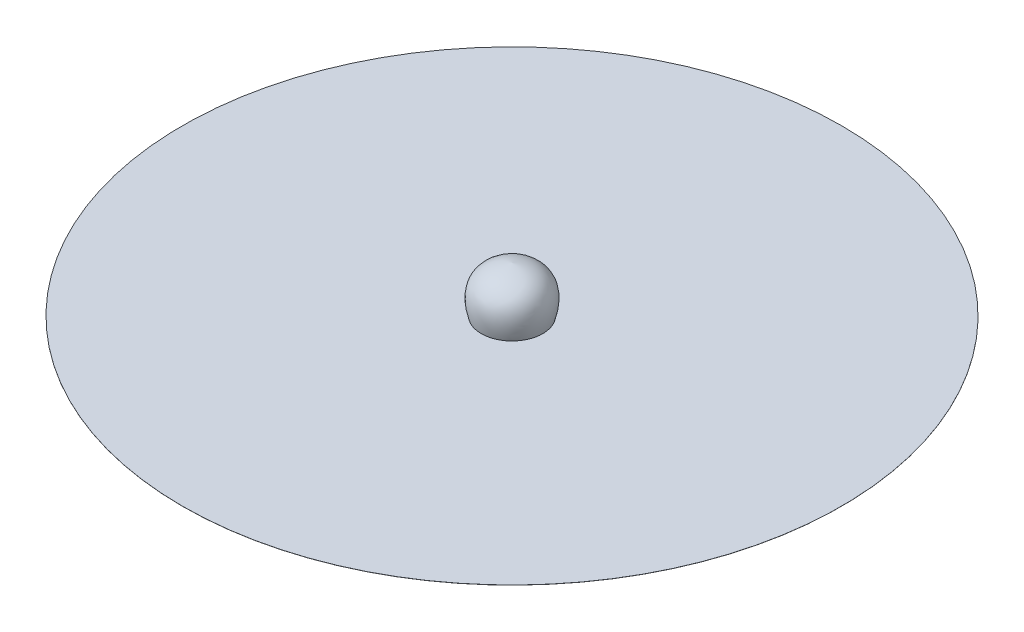
ISO-10303-21;
HEADER;
FILE_DESCRIPTION(('STEP AP214'),'2;1');
FILE_NAME('part.step','',(''),(''),'','','');
FILE_SCHEMA(('AUTOMOTIVE_DESIGN { 1 0 10303 214 1 1 1 1 }'));
ENDSEC;
DATA;
#1=APPLICATION_CONTEXT('core data for automotive mechanical design processes');
#2=APPLICATION_PROTOCOL_DEFINITION('international standard','automotive_design',2000,#1);
#3=PRODUCT_CONTEXT('',#1,'mechanical');
#4=PRODUCT('Part','Part','',(#3));
#5=PRODUCT_RELATED_PRODUCT_CATEGORY('part','',(#4));
#6=PRODUCT_DEFINITION_FORMATION('','',#4);
#7=PRODUCT_DEFINITION_CONTEXT('part definition',#1,'design');
#8=PRODUCT_DEFINITION('design','',#6,#7);
#9=PRODUCT_DEFINITION_SHAPE('','',#8);
#10=(LENGTH_UNIT() NAMED_UNIT(*) SI_UNIT(.MILLI.,.METRE.));
#11=(NAMED_UNIT(*) PLANE_ANGLE_UNIT() SI_UNIT($,.RADIAN.));
#12=(NAMED_UNIT(*) SI_UNIT($,.STERADIAN.) SOLID_ANGLE_UNIT());
#13=UNCERTAINTY_MEASURE_WITH_UNIT(LENGTH_MEASURE(1.E-05),#10,'distance_accuracy_value','');
#14=(GEOMETRIC_REPRESENTATION_CONTEXT(3) GLOBAL_UNCERTAINTY_ASSIGNED_CONTEXT((#13)) GLOBAL_UNIT_ASSIGNED_CONTEXT((#10,
#11,#12)) REPRESENTATION_CONTEXT('',''));
#15=CARTESIAN_POINT('',(0.,0.,0.));
#16=DIRECTION('',(0.,0.,1.));
#17=DIRECTION('',(1.,0.,0.));
#18=AXIS2_PLACEMENT_3D('',#15,#16,#17);
#19=CARTESIAN_POINT('',(-2567.16895900755,5.,0.));
#20=CARTESIAN_POINT('',(-3536.23026285343,3379.59816214911,0.));
#21=CARTESIAN_POINT('',(0.,3835.28856526429,0.));
#22=B_SPLINE_CURVE_WITH_KNOTS('',2,(#19,#20,#21),.UNSPECIFIED.,.F.,.F.,(3,3),(0.,1.),.UNSPECIFIED.);
#23=CARTESIAN_POINT('',(0.,0.,0.));
#24=DIRECTION('',(0.,1.,0.));
#25=AXIS1_PLACEMENT('',#23,#24);
#26=SURFACE_OF_REVOLUTION('',#22,#25);
#27=CARTESIAN_POINT('',(0.,3835.28856526429,0.));
#28=VERTEX_POINT('',#27);
#29=VERTEX_LOOP('',#28);
#30=FACE_BOUND('',#29,.T.);
#31=CARTESIAN_POINT('',(0.,5.,0.));
#32=DIRECTION('',(0.,1.,0.));
#33=DIRECTION('',(0.,0.,1.));
#34=AXIS2_PLACEMENT_3D('',#31,#32,#33);
#35=CIRCLE('',#34,2567.16895900755);
#36=CARTESIAN_POINT('',(0.,5.,2567.16895900755));
#37=VERTEX_POINT('',#36);
#38=EDGE_CURVE('E12',#37,#37,#35,.T.);
#39=ORIENTED_EDGE('',*,*,#38,.F.);
#40=EDGE_LOOP('',(#39));
#41=FACE_BOUND('',#40,.T.);
#42=ADVANCED_FACE('F49',(#30,#41),#26,.F.);
#43=OPEN_SHELL('',(#42));
#44=SHELL_BASED_SURFACE_MODEL('B2',(#43));
#45=CARTESIAN_POINT('',(0.,5.,0.));
#46=DIRECTION('',(0.,-1.,0.));
#47=DIRECTION('',(0.,0.,-1.));
#48=AXIS2_PLACEMENT_3D('',#45,#46,#47);
#49=CYLINDRICAL_SURFACE('',#48,27500.);
#50=CARTESIAN_POINT('',(0.,5.,0.));
#51=DIRECTION('',(0.,1.,0.));
#52=DIRECTION('',(0.,0.,1.));
#53=AXIS2_PLACEMENT_3D('',#50,#51,#52);
#54=CIRCLE('',#53,27500.);
#55=CARTESIAN_POINT('',(0.,5.,27500.));
#56=VERTEX_POINT('',#55);
#57=EDGE_CURVE('E48',#56,#56,#54,.T.);
#58=ORIENTED_EDGE('',*,*,#57,.F.);
#59=EDGE_LOOP('',(#58));
#60=FACE_BOUND('',#59,.T.);
#61=CARTESIAN_POINT('',(0.,-5.,0.));
#62=DIRECTION('',(0.,1.,0.));
#63=DIRECTION('',(0.,0.,1.));
#64=AXIS2_PLACEMENT_3D('',#61,#62,#63);
#65=CIRCLE('',#64,27500.);
#66=CARTESIAN_POINT('',(0.,-5.,27500.));
#67=VERTEX_POINT('',#66);
#68=EDGE_CURVE('E78',#67,#67,#65,.T.);
#69=ORIENTED_EDGE('',*,*,#68,.T.);
#70=EDGE_LOOP('',(#69));
#71=FACE_BOUND('',#70,.T.);
#72=ADVANCED_FACE('F75',(#60,#71),#49,.T.);
#73=CARTESIAN_POINT('',(0.,5.,0.));
#74=DIRECTION('',(0.,1.,0.));
#75=DIRECTION('',(0.,0.,1.));
#76=AXIS2_PLACEMENT_3D('',#73,#74,#75);
#77=PLANE('',#76);
#78=ORIENTED_EDGE('',*,*,#57,.T.);
#79=EDGE_LOOP('',(#78));
#80=FACE_BOUND('',#79,.T.);
#81=ADVANCED_FACE('F90',(#80),#77,.T.);
#82=CARTESIAN_POINT('',(0.,-5.,0.));
#83=DIRECTION('',(0.,1.,0.));
#84=DIRECTION('',(0.,0.,1.));
#85=AXIS2_PLACEMENT_3D('',#82,#83,#84);
#86=PLANE('',#85);
#87=ORIENTED_EDGE('',*,*,#68,.F.);
#88=EDGE_LOOP('',(#87));
#89=FACE_BOUND('',#88,.T.);
#90=ADVANCED_FACE('F88',(#89),#86,.F.);
#91=CLOSED_SHELL('',(#72,#81,#90));
#92=MANIFOLD_SOLID_BREP('B6',#91);
#93=ADVANCED_BREP_SHAPE_REPRESENTATION('',(#18,#92),#14);
#94=MANIFOLD_SURFACE_SHAPE_REPRESENTATION('',(#18,#44),#14);
#95=SHAPE_REPRESENTATION('',(#18),#14);
#96=SHAPE_DEFINITION_REPRESENTATION(#9,#95);
#97=SHAPE_REPRESENTATION_RELATIONSHIP('','',#95,#93);
#98=SHAPE_REPRESENTATION_RELATIONSHIP('','',#95,#94);
ENDSEC;
END-ISO-10303-21;
